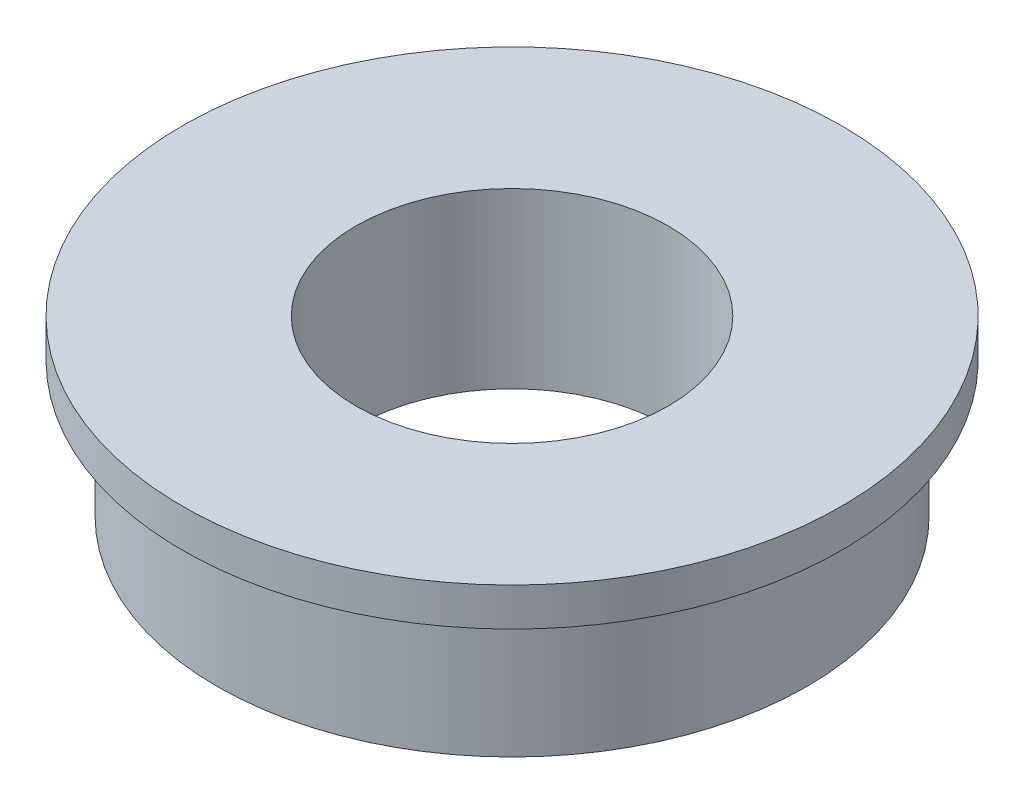
ISO-10303-21;
HEADER;
FILE_DESCRIPTION(('STEP AP214'),'2;1');
FILE_NAME('part.step','',(''),(''),'','','');
FILE_SCHEMA(('AUTOMOTIVE_DESIGN { 1 0 10303 214 1 1 1 1 }'));
ENDSEC;
DATA;
#1=APPLICATION_CONTEXT('core data for automotive mechanical design processes');
#2=APPLICATION_PROTOCOL_DEFINITION('international standard','automotive_design',2000,#1);
#3=PRODUCT_CONTEXT('',#1,'mechanical');
#4=PRODUCT('Part','Part','',(#3));
#5=PRODUCT_RELATED_PRODUCT_CATEGORY('part','',(#4));
#6=PRODUCT_DEFINITION_FORMATION('','',#4);
#7=PRODUCT_DEFINITION_CONTEXT('part definition',#1,'design');
#8=PRODUCT_DEFINITION('design','',#6,#7);
#9=PRODUCT_DEFINITION_SHAPE('','',#8);
#10=(LENGTH_UNIT() NAMED_UNIT(*) SI_UNIT(.MILLI.,.METRE.));
#11=(NAMED_UNIT(*) PLANE_ANGLE_UNIT() SI_UNIT($,.RADIAN.));
#12=(NAMED_UNIT(*) SI_UNIT($,.STERADIAN.) SOLID_ANGLE_UNIT());
#13=UNCERTAINTY_MEASURE_WITH_UNIT(LENGTH_MEASURE(1.E-05),#10,'distance_accuracy_value','');
#14=(GEOMETRIC_REPRESENTATION_CONTEXT(3) GLOBAL_UNCERTAINTY_ASSIGNED_CONTEXT((#13)) GLOBAL_UNIT_ASSIGNED_CONTEXT((#10,
#11,#12)) REPRESENTATION_CONTEXT('',''));
#15=CARTESIAN_POINT('',(0.,0.,0.));
#16=DIRECTION('',(0.,0.,1.));
#17=DIRECTION('',(1.,0.,0.));
#18=AXIS2_PLACEMENT_3D('',#15,#16,#17);
#19=CARTESIAN_POINT('',(0.,0.,0.));
#20=DIRECTION('',(0.,-1.,0.));
#21=DIRECTION('',(0.,0.,-1.));
#22=AXIS2_PLACEMENT_3D('',#19,#20,#21);
#23=CYLINDRICAL_SURFACE('',#22,9.5);
#24=CARTESIAN_POINT('',(0.,0.,0.));
#25=DIRECTION('',(0.,-1.,0.));
#26=DIRECTION('',(0.,0.,-1.));
#27=AXIS2_PLACEMENT_3D('',#24,#25,#26);
#28=CIRCLE('',#27,9.5);
#29=CARTESIAN_POINT('',(0.,0.,-9.5));
#30=VERTEX_POINT('',#29);
#31=EDGE_CURVE('E10',#30,#30,#28,.T.);
#32=ORIENTED_EDGE('',*,*,#31,.F.);
#33=EDGE_LOOP('',(#32));
#34=FACE_BOUND('',#33,.T.);
#35=CARTESIAN_POINT('',(0.,1.1,0.));
#36=DIRECTION('',(0.,-1.,0.));
#37=DIRECTION('',(0.,0.,-1.));
#38=AXIS2_PLACEMENT_3D('',#35,#36,#37);
#39=CIRCLE('',#38,9.5);
#40=CARTESIAN_POINT('',(0.,1.1,-9.5));
#41=VERTEX_POINT('',#40);
#42=EDGE_CURVE('E36',#41,#41,#39,.T.);
#43=ORIENTED_EDGE('',*,*,#42,.T.);
#44=EDGE_LOOP('',(#43));
#45=FACE_BOUND('',#44,.T.);
#46=ADVANCED_FACE('F14',(#34,#45),#23,.T.);
#47=CARTESIAN_POINT('',(-9.5,0.,0.));
#48=DIRECTION('',(0.,1.,0.));
#49=DIRECTION('',(0.,0.,1.));
#50=AXIS2_PLACEMENT_3D('',#47,#48,#49);
#51=PLANE('',#50);
#52=CARTESIAN_POINT('',(0.,0.,0.));
#53=DIRECTION('',(0.,-1.,0.));
#54=DIRECTION('',(0.,0.,-1.));
#55=AXIS2_PLACEMENT_3D('',#52,#53,#54);
#56=CIRCLE('',#55,8.5);
#57=CARTESIAN_POINT('',(0.,0.,-8.5));
#58=VERTEX_POINT('',#57);
#59=EDGE_CURVE('E20',#58,#58,#56,.T.);
#60=ORIENTED_EDGE('',*,*,#59,.F.);
#61=EDGE_LOOP('',(#60));
#62=FACE_BOUND('',#61,.T.);
#63=ORIENTED_EDGE('',*,*,#31,.T.);
#64=EDGE_LOOP('',(#63));
#65=FACE_BOUND('',#64,.T.);
#66=ADVANCED_FACE('F61',(#62,#65),#51,.F.);
#67=CARTESIAN_POINT('',(0.,0.,0.));
#68=DIRECTION('',(0.,-1.,0.));
#69=DIRECTION('',(0.,0.,-1.));
#70=AXIS2_PLACEMENT_3D('',#67,#68,#69);
#71=CYLINDRICAL_SURFACE('',#70,8.5);
#72=CARTESIAN_POINT('',(0.,-3.9,0.));
#73=DIRECTION('',(0.,-1.,0.));
#74=DIRECTION('',(0.,0.,-1.));
#75=AXIS2_PLACEMENT_3D('',#72,#73,#74);
#76=CIRCLE('',#75,8.5);
#77=CARTESIAN_POINT('',(0.,-3.9,-8.5));
#78=VERTEX_POINT('',#77);
#79=EDGE_CURVE('E24',#78,#78,#76,.T.);
#80=ORIENTED_EDGE('',*,*,#79,.F.);
#81=EDGE_LOOP('',(#80));
#82=FACE_BOUND('',#81,.T.);
#83=ORIENTED_EDGE('',*,*,#59,.T.);
#84=EDGE_LOOP('',(#83));
#85=FACE_BOUND('',#84,.T.);
#86=ADVANCED_FACE('F56',(#82,#85),#71,.T.);
#87=CARTESIAN_POINT('',(-8.5,-3.9,0.));
#88=DIRECTION('',(0.,1.,0.));
#89=DIRECTION('',(0.,0.,1.));
#90=AXIS2_PLACEMENT_3D('',#87,#88,#89);
#91=PLANE('',#90);
#92=CARTESIAN_POINT('',(0.,-3.9,0.));
#93=DIRECTION('',(0.,-1.,0.));
#94=DIRECTION('',(0.,0.,-1.));
#95=AXIS2_PLACEMENT_3D('',#92,#93,#94);
#96=CIRCLE('',#95,4.5);
#97=CARTESIAN_POINT('',(0.,-3.9,-4.5));
#98=VERTEX_POINT('',#97);
#99=EDGE_CURVE('E28',#98,#98,#96,.T.);
#100=ORIENTED_EDGE('',*,*,#99,.F.);
#101=EDGE_LOOP('',(#100));
#102=FACE_BOUND('',#101,.T.);
#103=ORIENTED_EDGE('',*,*,#79,.T.);
#104=EDGE_LOOP('',(#103));
#105=FACE_BOUND('',#104,.T.);
#106=ADVANCED_FACE('F50',(#102,#105),#91,.F.);
#107=CARTESIAN_POINT('',(0.,0.,0.));
#108=DIRECTION('',(0.,-1.,0.));
#109=DIRECTION('',(0.,0.,-1.));
#110=AXIS2_PLACEMENT_3D('',#107,#108,#109);
#111=CYLINDRICAL_SURFACE('',#110,4.5);
#112=CARTESIAN_POINT('',(0.,1.1,0.));
#113=DIRECTION('',(0.,-1.,0.));
#114=DIRECTION('',(0.,0.,-1.));
#115=AXIS2_PLACEMENT_3D('',#112,#113,#114);
#116=CIRCLE('',#115,4.5);
#117=CARTESIAN_POINT('',(0.,1.1,-4.5));
#118=VERTEX_POINT('',#117);
#119=EDGE_CURVE('E33',#118,#118,#116,.T.);
#120=ORIENTED_EDGE('',*,*,#119,.F.);
#121=EDGE_LOOP('',(#120));
#122=FACE_BOUND('',#121,.T.);
#123=ORIENTED_EDGE('',*,*,#99,.T.);
#124=EDGE_LOOP('',(#123));
#125=FACE_BOUND('',#124,.T.);
#126=ADVANCED_FACE('F44',(#122,#125),#111,.F.);
#127=CARTESIAN_POINT('',(-4.5,1.1,0.));
#128=DIRECTION('',(0.,-1.,0.));
#129=DIRECTION('',(0.,0.,-1.));
#130=AXIS2_PLACEMENT_3D('',#127,#128,#129);
#131=PLANE('',#130);
#132=ORIENTED_EDGE('',*,*,#42,.F.);
#133=EDGE_LOOP('',(#132));
#134=FACE_BOUND('',#133,.T.);
#135=ORIENTED_EDGE('',*,*,#119,.T.);
#136=EDGE_LOOP('',(#135));
#137=FACE_BOUND('',#136,.T.);
#138=ADVANCED_FACE('F41',(#134,#137),#131,.F.);
#139=CLOSED_SHELL('',(#46,#66,#86,#106,#126,#138));
#140=MANIFOLD_SOLID_BREP('B1',#139);
#141=ADVANCED_BREP_SHAPE_REPRESENTATION('',(#18,#140),#14);
#142=SHAPE_DEFINITION_REPRESENTATION(#9,#141);
ENDSEC;
END-ISO-10303-21;
